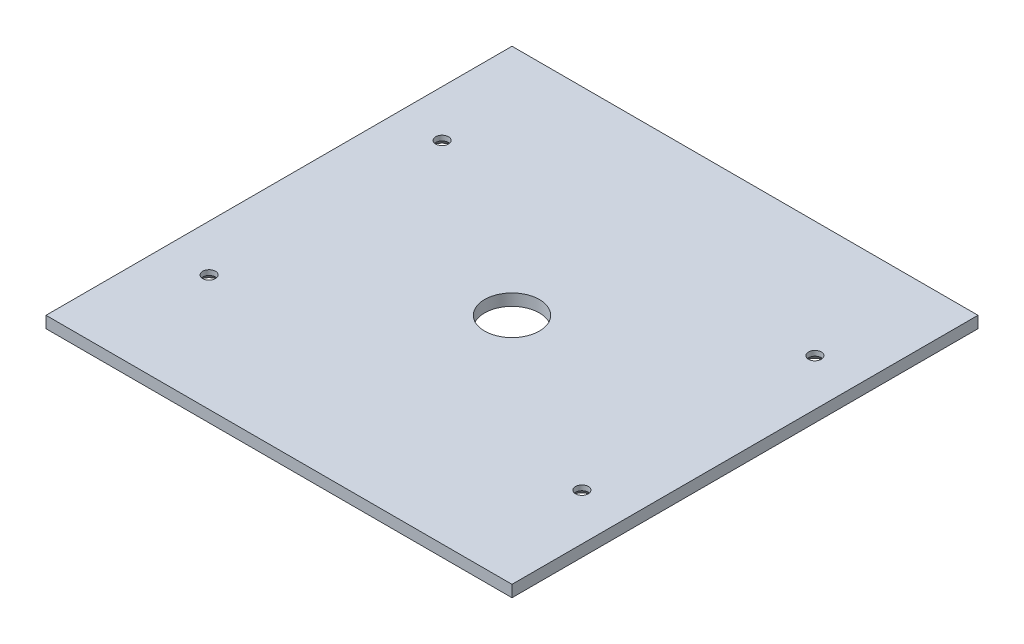
ISO-10303-21;
HEADER;
FILE_DESCRIPTION(('STEP AP214'),'2;1');
FILE_NAME('part.step','',(''),(''),'','','');
FILE_SCHEMA(('AUTOMOTIVE_DESIGN { 1 0 10303 214 1 1 1 1 }'));
ENDSEC;
DATA;
#1=APPLICATION_CONTEXT('core data for automotive mechanical design processes');
#2=APPLICATION_PROTOCOL_DEFINITION('international standard','automotive_design',2000,#1);
#3=PRODUCT_CONTEXT('',#1,'mechanical');
#4=PRODUCT('Part','Part','',(#3));
#5=PRODUCT_RELATED_PRODUCT_CATEGORY('part','',(#4));
#6=PRODUCT_DEFINITION_FORMATION('','',#4);
#7=PRODUCT_DEFINITION_CONTEXT('part definition',#1,'design');
#8=PRODUCT_DEFINITION('design','',#6,#7);
#9=PRODUCT_DEFINITION_SHAPE('','',#8);
#10=(LENGTH_UNIT() NAMED_UNIT(*) SI_UNIT(.MILLI.,.METRE.));
#11=(NAMED_UNIT(*) PLANE_ANGLE_UNIT() SI_UNIT($,.RADIAN.));
#12=(NAMED_UNIT(*) SI_UNIT($,.STERADIAN.) SOLID_ANGLE_UNIT());
#13=UNCERTAINTY_MEASURE_WITH_UNIT(LENGTH_MEASURE(1.E-05),#10,'distance_accuracy_value','');
#14=(GEOMETRIC_REPRESENTATION_CONTEXT(3) GLOBAL_UNCERTAINTY_ASSIGNED_CONTEXT((#13)) GLOBAL_UNIT_ASSIGNED_CONTEXT((#10,
#11,#12)) REPRESENTATION_CONTEXT('',''));
#15=CARTESIAN_POINT('',(0.,0.,0.));
#16=DIRECTION('',(0.,0.,1.));
#17=DIRECTION('',(1.,0.,0.));
#18=AXIS2_PLACEMENT_3D('',#15,#16,#17);
#19=CARTESIAN_POINT('',(0.,5.,0.));
#20=DIRECTION('',(-1.,0.,0.));
#21=DIRECTION('',(0.,0.,1.));
#22=AXIS2_PLACEMENT_3D('',#19,#20,#21);
#23=PLANE('',#22);
#24=DIRECTION('',(0.,0.,-1.));
#25=VECTOR('',#24,1.);
#26=CARTESIAN_POINT('',(0.,0.,0.));
#27=LINE('',#26,#25);
#28=CARTESIAN_POINT('',(0.,0.,0.));
#29=VERTEX_POINT('',#28);
#30=CARTESIAN_POINT('',(0.,0.,-200.));
#31=VERTEX_POINT('',#30);
#32=EDGE_CURVE('E101',#29,#31,#27,.T.);
#33=ORIENTED_EDGE('',*,*,#32,.T.);
#34=DIRECTION('',(0.,-1.,0.));
#35=VECTOR('',#34,1.);
#36=CARTESIAN_POINT('',(0.,5.,-200.));
#37=LINE('',#36,#35);
#38=CARTESIAN_POINT('',(0.,5.,-200.));
#39=VERTEX_POINT('',#38);
#40=EDGE_CURVE('E11',#39,#31,#37,.T.);
#41=ORIENTED_EDGE('',*,*,#40,.F.);
#42=DIRECTION('',(0.,0.,-1.));
#43=VECTOR('',#42,1.);
#44=CARTESIAN_POINT('',(0.,5.,0.));
#45=LINE('',#44,#43);
#46=CARTESIAN_POINT('',(0.,5.,0.));
#47=VERTEX_POINT('',#46);
#48=EDGE_CURVE('E88',#47,#39,#45,.T.);
#49=ORIENTED_EDGE('',*,*,#48,.F.);
#50=DIRECTION('',(0.,-1.,0.));
#51=VECTOR('',#50,1.);
#52=CARTESIAN_POINT('',(0.,5.,0.));
#53=LINE('',#52,#51);
#54=EDGE_CURVE('E97',#47,#29,#53,.T.);
#55=ORIENTED_EDGE('',*,*,#54,.T.);
#56=EDGE_LOOP('',(#33,#41,#49,#55));
#57=FACE_BOUND('',#56,.T.);
#58=ADVANCED_FACE('F35',(#57),#23,.F.);
#59=CARTESIAN_POINT('',(0.,5.,-200.));
#60=DIRECTION('',(0.,0.,1.));
#61=DIRECTION('',(1.,0.,0.));
#62=AXIS2_PLACEMENT_3D('',#59,#60,#61);
#63=PLANE('',#62);
#64=DIRECTION('',(-1.,0.,0.));
#65=VECTOR('',#64,1.);
#66=CARTESIAN_POINT('',(0.,0.,-200.));
#67=LINE('',#66,#65);
#68=CARTESIAN_POINT('',(-200.,0.,-200.));
#69=VERTEX_POINT('',#68);
#70=EDGE_CURVE('E92',#31,#69,#67,.T.);
#71=ORIENTED_EDGE('',*,*,#70,.T.);
#72=DIRECTION('',(0.,-1.,0.));
#73=VECTOR('',#72,1.);
#74=CARTESIAN_POINT('',(-200.,5.,-200.));
#75=LINE('',#74,#73);
#76=CARTESIAN_POINT('',(-200.,5.,-200.));
#77=VERTEX_POINT('',#76);
#78=EDGE_CURVE('E44',#77,#69,#75,.T.);
#79=ORIENTED_EDGE('',*,*,#78,.F.);
#80=DIRECTION('',(-1.,0.,0.));
#81=VECTOR('',#80,1.);
#82=CARTESIAN_POINT('',(0.,5.,-200.));
#83=LINE('',#82,#81);
#84=EDGE_CURVE('E83',#39,#77,#83,.T.);
#85=ORIENTED_EDGE('',*,*,#84,.F.);
#86=ORIENTED_EDGE('',*,*,#40,.T.);
#87=EDGE_LOOP('',(#71,#79,#85,#86));
#88=FACE_BOUND('',#87,.T.);
#89=ADVANCED_FACE('F91',(#88),#63,.F.);
#90=CARTESIAN_POINT('',(-200.,5.,0.));
#91=DIRECTION('',(1.,0.,0.));
#92=DIRECTION('',(0.,0.,-1.));
#93=AXIS2_PLACEMENT_3D('',#90,#91,#92);
#94=PLANE('',#93);
#95=DIRECTION('',(0.,0.,1.));
#96=VECTOR('',#95,1.);
#97=CARTESIAN_POINT('',(-200.,0.,0.));
#98=LINE('',#97,#96);
#99=CARTESIAN_POINT('',(-200.,0.,0.));
#100=VERTEX_POINT('',#99);
#101=EDGE_CURVE('E70',#69,#100,#98,.T.);
#102=ORIENTED_EDGE('',*,*,#101,.T.);
#103=DIRECTION('',(0.,-1.,0.));
#104=VECTOR('',#103,1.);
#105=CARTESIAN_POINT('',(-200.,5.,0.));
#106=LINE('',#105,#104);
#107=CARTESIAN_POINT('',(-200.,5.,0.));
#108=VERTEX_POINT('',#107);
#109=EDGE_CURVE('E93',#108,#100,#106,.T.);
#110=ORIENTED_EDGE('',*,*,#109,.F.);
#111=DIRECTION('',(0.,0.,1.));
#112=VECTOR('',#111,1.);
#113=CARTESIAN_POINT('',(-200.,5.,0.));
#114=LINE('',#113,#112);
#115=EDGE_CURVE('E86',#77,#108,#114,.T.);
#116=ORIENTED_EDGE('',*,*,#115,.F.);
#117=ORIENTED_EDGE('',*,*,#78,.T.);
#118=EDGE_LOOP('',(#102,#110,#116,#117));
#119=FACE_BOUND('',#118,.T.);
#120=ADVANCED_FACE('F95',(#119),#94,.F.);
#121=CARTESIAN_POINT('',(0.,5.,0.));
#122=DIRECTION('',(0.,0.,-1.));
#123=DIRECTION('',(-1.,0.,0.));
#124=AXIS2_PLACEMENT_3D('',#121,#122,#123);
#125=PLANE('',#124);
#126=DIRECTION('',(1.,0.,0.));
#127=VECTOR('',#126,1.);
#128=CARTESIAN_POINT('',(0.,0.,0.));
#129=LINE('',#128,#127);
#130=EDGE_CURVE('E76',#100,#29,#129,.T.);
#131=ORIENTED_EDGE('',*,*,#130,.T.);
#132=ORIENTED_EDGE('',*,*,#54,.F.);
#133=DIRECTION('',(1.,0.,0.));
#134=VECTOR('',#133,1.);
#135=CARTESIAN_POINT('',(0.,5.,0.));
#136=LINE('',#135,#134);
#137=EDGE_CURVE('E53',#108,#47,#136,.T.);
#138=ORIENTED_EDGE('',*,*,#137,.F.);
#139=ORIENTED_EDGE('',*,*,#109,.T.);
#140=EDGE_LOOP('',(#131,#132,#138,#139));
#141=FACE_BOUND('',#140,.T.);
#142=ADVANCED_FACE('F157',(#141),#125,.F.);
#143=CARTESIAN_POINT('',(0.,5.,0.));
#144=DIRECTION('',(0.,1.,0.));
#145=DIRECTION('',(0.,0.,1.));
#146=AXIS2_PLACEMENT_3D('',#143,#144,#145);
#147=PLANE('',#146);
#148=CARTESIAN_POINT('',(-100.,5.,-100.));
#149=DIRECTION('',(0.,1.,0.));
#150=DIRECTION('',(0.,0.,1.));
#151=AXIS2_PLACEMENT_3D('',#148,#149,#150);
#152=CIRCLE('',#151,11.75);
#153=CARTESIAN_POINT('',(-100.,5.,-88.25));
#154=VERTEX_POINT('',#153);
#155=EDGE_CURVE('E283',#154,#154,#152,.T.);
#156=ORIENTED_EDGE('',*,*,#155,.F.);
#157=EDGE_LOOP('',(#156));
#158=FACE_BOUND('',#157,.T.);
#159=CARTESIAN_POINT('',(-180.,5.,-50.));
#160=DIRECTION('',(0.,1.,0.));
#161=DIRECTION('',(0.,0.,1.));
#162=AXIS2_PLACEMENT_3D('',#159,#160,#161);
#163=CIRCLE('',#162,2.74999999999999);
#164=CARTESIAN_POINT('',(-180.,5.,-47.25));
#165=VERTEX_POINT('',#164);
#166=EDGE_CURVE('E38',#165,#165,#163,.T.);
#167=ORIENTED_EDGE('',*,*,#166,.F.);
#168=EDGE_LOOP('',(#167));
#169=FACE_BOUND('',#168,.T.);
#170=CARTESIAN_POINT('',(-180.,5.,-150.));
#171=DIRECTION('',(0.,1.,0.));
#172=DIRECTION('',(0.,0.,1.));
#173=AXIS2_PLACEMENT_3D('',#170,#171,#172);
#174=CIRCLE('',#173,2.74999999999999);
#175=CARTESIAN_POINT('',(-180.,5.,-147.25));
#176=VERTEX_POINT('',#175);
#177=EDGE_CURVE('E117',#176,#176,#174,.T.);
#178=ORIENTED_EDGE('',*,*,#177,.F.);
#179=EDGE_LOOP('',(#178));
#180=FACE_BOUND('',#179,.T.);
#181=CARTESIAN_POINT('',(-20.,5.,-50.));
#182=DIRECTION('',(0.,1.,0.));
#183=DIRECTION('',(0.,0.,1.));
#184=AXIS2_PLACEMENT_3D('',#181,#182,#183);
#185=CIRCLE('',#184,2.74999999999999);
#186=CARTESIAN_POINT('',(-20.,5.,-47.25));
#187=VERTEX_POINT('',#186);
#188=EDGE_CURVE('E113',#187,#187,#185,.T.);
#189=ORIENTED_EDGE('',*,*,#188,.F.);
#190=EDGE_LOOP('',(#189));
#191=FACE_BOUND('',#190,.T.);
#192=CARTESIAN_POINT('',(-20.,5.,-150.));
#193=DIRECTION('',(0.,1.,0.));
#194=DIRECTION('',(0.,0.,1.));
#195=AXIS2_PLACEMENT_3D('',#192,#193,#194);
#196=CIRCLE('',#195,2.74999999999999);
#197=CARTESIAN_POINT('',(-20.,5.,-147.25));
#198=VERTEX_POINT('',#197);
#199=EDGE_CURVE('E104',#198,#198,#196,.T.);
#200=ORIENTED_EDGE('',*,*,#199,.F.);
#201=EDGE_LOOP('',(#200));
#202=FACE_BOUND('',#201,.T.);
#203=ORIENTED_EDGE('',*,*,#48,.T.);
#204=ORIENTED_EDGE('',*,*,#84,.T.);
#205=ORIENTED_EDGE('',*,*,#115,.T.);
#206=ORIENTED_EDGE('',*,*,#137,.T.);
#207=EDGE_LOOP('',(#203,#204,#205,#206));
#208=FACE_BOUND('',#207,.T.);
#209=ADVANCED_FACE('F84',(#158,#169,#180,#191,#202,#208),#147,.T.);
#210=CARTESIAN_POINT('',(0.,0.,0.));
#211=DIRECTION('',(0.,1.,0.));
#212=DIRECTION('',(0.,0.,1.));
#213=AXIS2_PLACEMENT_3D('',#210,#211,#212);
#214=PLANE('',#213);
#215=CARTESIAN_POINT('',(-100.,0.,-100.));
#216=DIRECTION('',(0.,-1.,0.));
#217=DIRECTION('',(0.,0.,-1.));
#218=AXIS2_PLACEMENT_3D('',#215,#216,#217);
#219=CIRCLE('',#218,11.75);
#220=CARTESIAN_POINT('',(-100.,0.,-111.75));
#221=VERTEX_POINT('',#220);
#222=EDGE_CURVE('E286',#221,#221,#219,.T.);
#223=ORIENTED_EDGE('',*,*,#222,.F.);
#224=EDGE_LOOP('',(#223));
#225=FACE_BOUND('',#224,.T.);
#226=CARTESIAN_POINT('',(-180.,0.,-50.));
#227=DIRECTION('',(0.,-1.,0.));
#228=DIRECTION('',(0.,0.,-1.));
#229=AXIS2_PLACEMENT_3D('',#226,#227,#228);
#230=CIRCLE('',#229,5.59999999999999);
#231=CARTESIAN_POINT('',(-180.,0.,-55.6));
#232=VERTEX_POINT('',#231);
#233=EDGE_CURVE('E288',#232,#232,#230,.T.);
#234=ORIENTED_EDGE('',*,*,#233,.F.);
#235=EDGE_LOOP('',(#234));
#236=FACE_BOUND('',#235,.T.);
#237=CARTESIAN_POINT('',(-180.,0.,-150.));
#238=DIRECTION('',(0.,-1.,0.));
#239=DIRECTION('',(0.,0.,-1.));
#240=AXIS2_PLACEMENT_3D('',#237,#238,#239);
#241=CIRCLE('',#240,5.59999999999999);
#242=CARTESIAN_POINT('',(-180.,0.,-155.6));
#243=VERTEX_POINT('',#242);
#244=EDGE_CURVE('E126',#243,#243,#241,.T.);
#245=ORIENTED_EDGE('',*,*,#244,.F.);
#246=EDGE_LOOP('',(#245));
#247=FACE_BOUND('',#246,.T.);
#248=CARTESIAN_POINT('',(-20.,0.,-50.));
#249=DIRECTION('',(0.,-1.,0.));
#250=DIRECTION('',(0.,0.,-1.));
#251=AXIS2_PLACEMENT_3D('',#248,#249,#250);
#252=CIRCLE('',#251,5.6);
#253=CARTESIAN_POINT('',(-20.,0.,-55.6));
#254=VERTEX_POINT('',#253);
#255=EDGE_CURVE('E119',#254,#254,#252,.T.);
#256=ORIENTED_EDGE('',*,*,#255,.F.);
#257=EDGE_LOOP('',(#256));
#258=FACE_BOUND('',#257,.T.);
#259=CARTESIAN_POINT('',(-20.,0.,-150.));
#260=DIRECTION('',(0.,-1.,0.));
#261=DIRECTION('',(0.,0.,-1.));
#262=AXIS2_PLACEMENT_3D('',#259,#260,#261);
#263=CIRCLE('',#262,5.6);
#264=CARTESIAN_POINT('',(-20.,0.,-155.6));
#265=VERTEX_POINT('',#264);
#266=EDGE_CURVE('E115',#265,#265,#263,.T.);
#267=ORIENTED_EDGE('',*,*,#266,.F.);
#268=EDGE_LOOP('',(#267));
#269=FACE_BOUND('',#268,.T.);
#270=ORIENTED_EDGE('',*,*,#32,.F.);
#271=ORIENTED_EDGE('',*,*,#130,.F.);
#272=ORIENTED_EDGE('',*,*,#101,.F.);
#273=ORIENTED_EDGE('',*,*,#70,.F.);
#274=EDGE_LOOP('',(#270,#271,#272,#273));
#275=FACE_BOUND('',#274,.T.);
#276=ADVANCED_FACE('F150',(#225,#236,#247,#258,#269,#275),#214,.F.);
#277=CARTESIAN_POINT('',(-20.,0.,-150.));
#278=DIRECTION('',(0.,-1.,0.));
#279=DIRECTION('',(0.,0.,-1.));
#280=AXIS2_PLACEMENT_3D('',#277,#278,#279);
#281=CYLINDRICAL_SURFACE('',#280,2.74999999999999);
#282=ORIENTED_EDGE('',*,*,#199,.T.);
#283=EDGE_LOOP('',(#282));
#284=FACE_BOUND('',#283,.T.);
#285=CARTESIAN_POINT('',(-20.,2.85,-150.));
#286=DIRECTION('',(0.,-1.,0.));
#287=DIRECTION('',(0.,0.,-1.));
#288=AXIS2_PLACEMENT_3D('',#285,#286,#287);
#289=CIRCLE('',#288,2.75);
#290=CARTESIAN_POINT('',(-20.,2.85,-152.75));
#291=VERTEX_POINT('',#290);
#292=EDGE_CURVE('E112',#291,#291,#289,.T.);
#293=ORIENTED_EDGE('',*,*,#292,.T.);
#294=EDGE_LOOP('',(#293));
#295=FACE_BOUND('',#294,.T.);
#296=ADVANCED_FACE('F141',(#284,#295),#281,.F.);
#297=CARTESIAN_POINT('',(-20.,0.,-150.));
#298=DIRECTION('',(0.,-1.,0.));
#299=DIRECTION('',(0.,0.,-1.));
#300=AXIS2_PLACEMENT_3D('',#297,#298,#299);
#301=CONICAL_SURFACE('',#300,5.6,0.785398163397448);
#302=ORIENTED_EDGE('',*,*,#292,.F.);
#303=EDGE_LOOP('',(#302));
#304=FACE_BOUND('',#303,.T.);
#305=ORIENTED_EDGE('',*,*,#266,.T.);
#306=EDGE_LOOP('',(#305));
#307=FACE_BOUND('',#306,.T.);
#308=ADVANCED_FACE('F143',(#304,#307),#301,.F.);
#309=CARTESIAN_POINT('',(-20.,0.,-50.));
#310=DIRECTION('',(0.,-1.,0.));
#311=DIRECTION('',(0.,0.,-1.));
#312=AXIS2_PLACEMENT_3D('',#309,#310,#311);
#313=CYLINDRICAL_SURFACE('',#312,2.74999999999999);
#314=ORIENTED_EDGE('',*,*,#188,.T.);
#315=EDGE_LOOP('',(#314));
#316=FACE_BOUND('',#315,.T.);
#317=CARTESIAN_POINT('',(-20.,2.85,-50.));
#318=DIRECTION('',(0.,-1.,0.));
#319=DIRECTION('',(0.,0.,-1.));
#320=AXIS2_PLACEMENT_3D('',#317,#318,#319);
#321=CIRCLE('',#320,2.75);
#322=CARTESIAN_POINT('',(-20.,2.85,-52.75));
#323=VERTEX_POINT('',#322);
#324=EDGE_CURVE('E116',#323,#323,#321,.T.);
#325=ORIENTED_EDGE('',*,*,#324,.T.);
#326=EDGE_LOOP('',(#325));
#327=FACE_BOUND('',#326,.T.);
#328=ADVANCED_FACE('F146',(#316,#327),#313,.F.);
#329=CARTESIAN_POINT('',(-20.,0.,-50.));
#330=DIRECTION('',(0.,-1.,0.));
#331=DIRECTION('',(0.,0.,-1.));
#332=AXIS2_PLACEMENT_3D('',#329,#330,#331);
#333=CONICAL_SURFACE('',#332,5.6,0.785398163397448);
#334=ORIENTED_EDGE('',*,*,#324,.F.);
#335=EDGE_LOOP('',(#334));
#336=FACE_BOUND('',#335,.T.);
#337=ORIENTED_EDGE('',*,*,#255,.T.);
#338=EDGE_LOOP('',(#337));
#339=FACE_BOUND('',#338,.T.);
#340=ADVANCED_FACE('F207',(#336,#339),#333,.F.);
#341=CARTESIAN_POINT('',(-180.,0.,-150.));
#342=DIRECTION('',(0.,-1.,0.));
#343=DIRECTION('',(0.,0.,-1.));
#344=AXIS2_PLACEMENT_3D('',#341,#342,#343);
#345=CYLINDRICAL_SURFACE('',#344,2.74999999999999);
#346=ORIENTED_EDGE('',*,*,#177,.T.);
#347=EDGE_LOOP('',(#346));
#348=FACE_BOUND('',#347,.T.);
#349=CARTESIAN_POINT('',(-180.,2.85,-150.));
#350=DIRECTION('',(0.,-1.,0.));
#351=DIRECTION('',(0.,0.,-1.));
#352=AXIS2_PLACEMENT_3D('',#349,#350,#351);
#353=CIRCLE('',#352,2.75);
#354=CARTESIAN_POINT('',(-180.,2.85,-152.75));
#355=VERTEX_POINT('',#354);
#356=EDGE_CURVE('E120',#355,#355,#353,.T.);
#357=ORIENTED_EDGE('',*,*,#356,.T.);
#358=EDGE_LOOP('',(#357));
#359=FACE_BOUND('',#358,.T.);
#360=ADVANCED_FACE('F217',(#348,#359),#345,.F.);
#361=CARTESIAN_POINT('',(-180.,0.,-150.));
#362=DIRECTION('',(0.,-1.,0.));
#363=DIRECTION('',(0.,0.,-1.));
#364=AXIS2_PLACEMENT_3D('',#361,#362,#363);
#365=CONICAL_SURFACE('',#364,5.59999999999999,0.785398163397447);
#366=ORIENTED_EDGE('',*,*,#356,.F.);
#367=EDGE_LOOP('',(#366));
#368=FACE_BOUND('',#367,.T.);
#369=ORIENTED_EDGE('',*,*,#244,.T.);
#370=EDGE_LOOP('',(#369));
#371=FACE_BOUND('',#370,.T.);
#372=ADVANCED_FACE('F227',(#368,#371),#365,.F.);
#373=CARTESIAN_POINT('',(-180.,0.,-50.));
#374=DIRECTION('',(0.,-1.,0.));
#375=DIRECTION('',(0.,0.,-1.));
#376=AXIS2_PLACEMENT_3D('',#373,#374,#375);
#377=CYLINDRICAL_SURFACE('',#376,2.74999999999999);
#378=ORIENTED_EDGE('',*,*,#166,.T.);
#379=EDGE_LOOP('',(#378));
#380=FACE_BOUND('',#379,.T.);
#381=CARTESIAN_POINT('',(-180.,2.85,-50.));
#382=DIRECTION('',(0.,-1.,0.));
#383=DIRECTION('',(0.,0.,-1.));
#384=AXIS2_PLACEMENT_3D('',#381,#382,#383);
#385=CIRCLE('',#384,2.75);
#386=CARTESIAN_POINT('',(-180.,2.85,-52.75));
#387=VERTEX_POINT('',#386);
#388=EDGE_CURVE('E292',#387,#387,#385,.T.);
#389=ORIENTED_EDGE('',*,*,#388,.T.);
#390=EDGE_LOOP('',(#389));
#391=FACE_BOUND('',#390,.T.);
#392=ADVANCED_FACE('F236',(#380,#391),#377,.F.);
#393=CARTESIAN_POINT('',(-180.,0.,-50.));
#394=DIRECTION('',(0.,-1.,0.));
#395=DIRECTION('',(0.,0.,-1.));
#396=AXIS2_PLACEMENT_3D('',#393,#394,#395);
#397=CONICAL_SURFACE('',#396,5.59999999999999,0.785398163397447);
#398=ORIENTED_EDGE('',*,*,#388,.F.);
#399=EDGE_LOOP('',(#398));
#400=FACE_BOUND('',#399,.T.);
#401=ORIENTED_EDGE('',*,*,#233,.T.);
#402=EDGE_LOOP('',(#401));
#403=FACE_BOUND('',#402,.T.);
#404=ADVANCED_FACE('F246',(#400,#403),#397,.F.);
#405=CARTESIAN_POINT('',(-100.,10.,-100.));
#406=DIRECTION('',(0.,-1.,0.));
#407=DIRECTION('',(0.,0.,-1.));
#408=AXIS2_PLACEMENT_3D('',#405,#406,#407);
#409=CYLINDRICAL_SURFACE('',#408,11.75);
#410=ORIENTED_EDGE('',*,*,#155,.T.);
#411=EDGE_LOOP('',(#410));
#412=FACE_BOUND('',#411,.T.);
#413=ORIENTED_EDGE('',*,*,#222,.T.);
#414=EDGE_LOOP('',(#413));
#415=FACE_BOUND('',#414,.T.);
#416=ADVANCED_FACE('F256',(#412,#415),#409,.F.);
#417=CLOSED_SHELL('',(#58,#89,#120,#142,#209,#276,#296,#308,#328,#340,#360,#372,#392,#404,#416));
#418=MANIFOLD_SOLID_BREP('B2',#417);
#419=ADVANCED_BREP_SHAPE_REPRESENTATION('',(#18,#418),#14);
#420=SHAPE_DEFINITION_REPRESENTATION(#9,#419);
ENDSEC;
END-ISO-10303-21;
